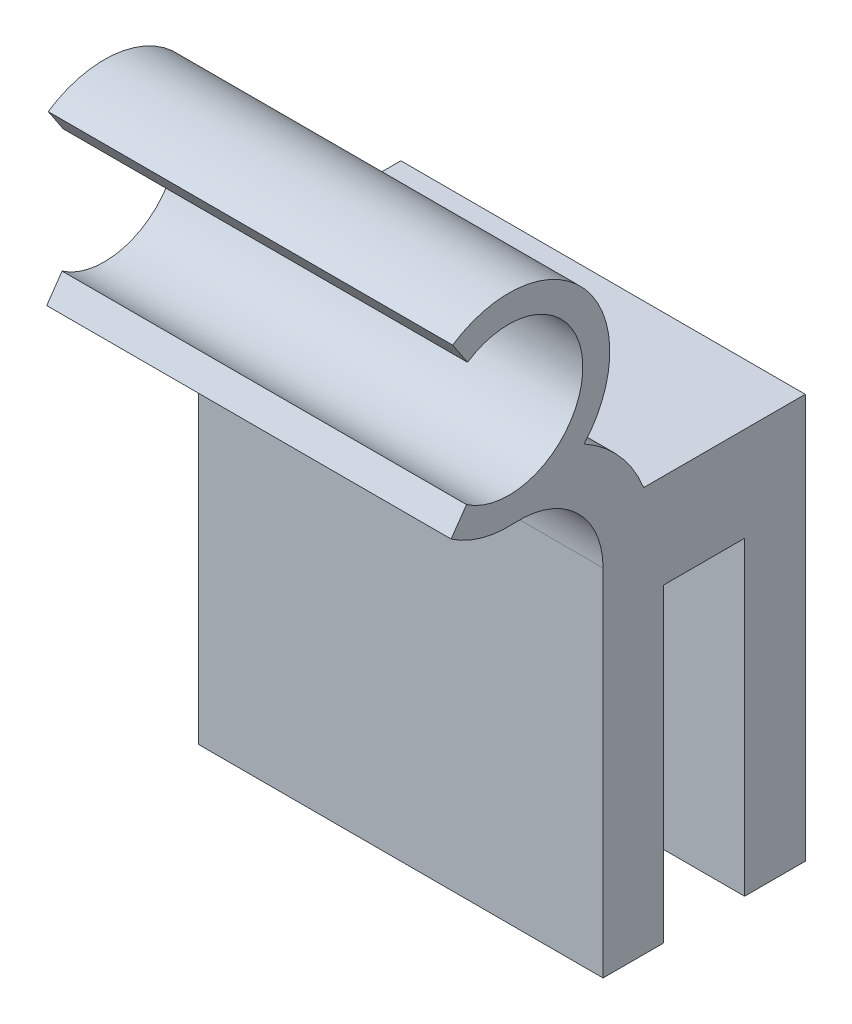
ISO-10303-21;
HEADER;
FILE_DESCRIPTION(('STEP AP214'),'2;1');
FILE_NAME('part.step','',(''),(''),'','','');
FILE_SCHEMA(('AUTOMOTIVE_DESIGN { 1 0 10303 214 1 1 1 1 }'));
ENDSEC;
DATA;
#1=APPLICATION_CONTEXT('core data for automotive mechanical design processes');
#2=APPLICATION_PROTOCOL_DEFINITION('international standard','automotive_design',2000,#1);
#3=PRODUCT_CONTEXT('',#1,'mechanical');
#4=PRODUCT('Part','Part','',(#3));
#5=PRODUCT_RELATED_PRODUCT_CATEGORY('part','',(#4));
#6=PRODUCT_DEFINITION_FORMATION('','',#4);
#7=PRODUCT_DEFINITION_CONTEXT('part definition',#1,'design');
#8=PRODUCT_DEFINITION('design','',#6,#7);
#9=PRODUCT_DEFINITION_SHAPE('','',#8);
#10=(LENGTH_UNIT() NAMED_UNIT(*) SI_UNIT(.MILLI.,.METRE.));
#11=(NAMED_UNIT(*) PLANE_ANGLE_UNIT() SI_UNIT($,.RADIAN.));
#12=(NAMED_UNIT(*) SI_UNIT($,.STERADIAN.) SOLID_ANGLE_UNIT());
#13=UNCERTAINTY_MEASURE_WITH_UNIT(LENGTH_MEASURE(1.E-05),#10,'distance_accuracy_value','');
#14=(GEOMETRIC_REPRESENTATION_CONTEXT(3) GLOBAL_UNCERTAINTY_ASSIGNED_CONTEXT((#13)) GLOBAL_UNIT_ASSIGNED_CONTEXT((#10,
#11,#12)) REPRESENTATION_CONTEXT('',''));
#15=CARTESIAN_POINT('',(0.,0.,0.));
#16=DIRECTION('',(0.,0.,1.));
#17=DIRECTION('',(1.,0.,0.));
#18=AXIS2_PLACEMENT_3D('',#15,#16,#17);
#19=CARTESIAN_POINT('',(15.,6.86224857327043,13.6819162353637));
#20=DIRECTION('',(-1.,0.,0.));
#21=DIRECTION('',(0.,0.,1.));
#22=AXIS2_PLACEMENT_3D('',#19,#20,#21);
#23=CYLINDRICAL_SURFACE('',#22,9.89666231497633);
#24=CARTESIAN_POINT('',(-15.,6.86224857327043,13.6819162353637));
#25=DIRECTION('',(1.,0.,0.));
#26=DIRECTION('',(0.,0.,-1.));
#27=AXIS2_PLACEMENT_3D('',#24,#25,#26);
#28=CIRCLE('',#27,9.89666231497633);
#29=CARTESIAN_POINT('',(-15.,10.5196850393701,4.48587994394355));
#30=VERTEX_POINT('',#29);
#31=CARTESIAN_POINT('',(-15.,15.5281910752581,8.90223365919645));
#32=VERTEX_POINT('',#31);
#33=EDGE_CURVE('E186',#30,#32,#28,.T.);
#34=ORIENTED_EDGE('',*,*,#33,.T.);
#35=DIRECTION('',(-1.,0.,0.));
#36=VECTOR('',#35,1.);
#37=CARTESIAN_POINT('',(15.,15.5281910752581,8.90223365919645));
#38=LINE('',#37,#36);
#39=CARTESIAN_POINT('',(15.,15.5281910752581,8.90223365919645));
#40=VERTEX_POINT('',#39);
#41=EDGE_CURVE('E11',#40,#32,#38,.T.);
#42=ORIENTED_EDGE('',*,*,#41,.F.);
#43=CARTESIAN_POINT('',(15.,6.86224857327043,13.6819162353637));
#44=DIRECTION('',(1.,0.,0.));
#45=DIRECTION('',(0.,0.,-1.));
#46=AXIS2_PLACEMENT_3D('',#43,#44,#45);
#47=CIRCLE('',#46,9.89666231497633);
#48=CARTESIAN_POINT('',(15.,10.5196850393701,4.48587994394355));
#49=VERTEX_POINT('',#48);
#50=EDGE_CURVE('E229',#49,#40,#47,.T.);
#51=ORIENTED_EDGE('',*,*,#50,.F.);
#52=DIRECTION('',(-1.,0.,0.));
#53=VECTOR('',#52,1.);
#54=CARTESIAN_POINT('',(15.,10.5196850393701,4.48587994394355));
#55=LINE('',#54,#53);
#56=EDGE_CURVE('E182',#49,#30,#55,.T.);
#57=ORIENTED_EDGE('',*,*,#56,.T.);
#58=EDGE_LOOP('',(#34,#42,#51,#57));
#59=FACE_BOUND('',#58,.T.);
#60=ADVANCED_FACE('F43',(#59),#23,.T.);
#61=CARTESIAN_POINT('',(15.,20.5196850393701,14.5));
#62=DIRECTION('',(-1.,0.,0.));
#63=DIRECTION('',(0.,0.,1.));
#64=AXIS2_PLACEMENT_3D('',#61,#62,#63);
#65=CYLINDRICAL_SURFACE('',#64,7.5);
#66=CARTESIAN_POINT('',(-15.,20.5196850393701,14.5));
#67=DIRECTION('',(1.,0.,0.));
#68=DIRECTION('',(0.,0.,-1.));
#69=AXIS2_PLACEMENT_3D('',#66,#67,#68);
#70=CIRCLE('',#69,7.5);
#71=CARTESIAN_POINT('',(-15.,26.7607964667778,18.6591499312577));
#72=VERTEX_POINT('',#71);
#73=EDGE_CURVE('E190',#32,#72,#70,.T.);
#74=ORIENTED_EDGE('',*,*,#73,.T.);
#75=DIRECTION('',(-1.,0.,0.));
#76=VECTOR('',#75,1.);
#77=CARTESIAN_POINT('',(15.,26.7607964667778,18.6591499312577));
#78=LINE('',#77,#76);
#79=CARTESIAN_POINT('',(15.,26.7607964667778,18.6591499312577));
#80=VERTEX_POINT('',#79);
#81=EDGE_CURVE('E52',#80,#72,#78,.T.);
#82=ORIENTED_EDGE('',*,*,#81,.F.);
#83=CARTESIAN_POINT('',(15.,20.5196850393701,14.5));
#84=DIRECTION('',(1.,0.,0.));
#85=DIRECTION('',(0.,0.,-1.));
#86=AXIS2_PLACEMENT_3D('',#83,#84,#85);
#87=CIRCLE('',#86,7.5);
#88=EDGE_CURVE('E124',#40,#80,#87,.T.);
#89=ORIENTED_EDGE('',*,*,#88,.F.);
#90=ORIENTED_EDGE('',*,*,#41,.T.);
#91=EDGE_LOOP('',(#74,#82,#89,#90));
#92=FACE_BOUND('',#91,.T.);
#93=ADVANCED_FACE('F344',(#92),#65,.T.);
#94=CARTESIAN_POINT('',(15.,26.7607964667778,18.6591499312577));
#95=DIRECTION('',(0.,0.554553324167686,-0.832148190321032));
#96=DIRECTION('',(0.,0.832148190321032,0.554553324167686));
#97=AXIS2_PLACEMENT_3D('',#94,#95,#96);
#98=PLANE('',#97);
#99=DIRECTION('',(0.,-0.832148190321032,-0.554553324167686));
#100=VECTOR('',#99,1.);
#101=CARTESIAN_POINT('',(-15.,26.7607964667778,18.6591499312577));
#102=LINE('',#101,#100);
#103=CARTESIAN_POINT('',(-15.,25.0965000861358,17.5500432829223));
#104=VERTEX_POINT('',#103);
#105=EDGE_CURVE('E193',#72,#104,#102,.T.);
#106=ORIENTED_EDGE('',*,*,#105,.T.);
#107=DIRECTION('',(-1.,0.,0.));
#108=VECTOR('',#107,1.);
#109=CARTESIAN_POINT('',(15.,25.0965000861358,17.5500432829223));
#110=LINE('',#109,#108);
#111=CARTESIAN_POINT('',(15.,25.0965000861358,17.5500432829223));
#112=VERTEX_POINT('',#111);
#113=EDGE_CURVE('E268',#112,#104,#110,.T.);
#114=ORIENTED_EDGE('',*,*,#113,.F.);
#115=DIRECTION('',(0.,-0.832148190321032,-0.554553324167686));
#116=VECTOR('',#115,1.);
#117=CARTESIAN_POINT('',(15.,26.7607964667778,18.6591499312577));
#118=LINE('',#117,#116);
#119=EDGE_CURVE('E278',#80,#112,#118,.T.);
#120=ORIENTED_EDGE('',*,*,#119,.F.);
#121=ORIENTED_EDGE('',*,*,#81,.T.);
#122=EDGE_LOOP('',(#106,#114,#120,#121));
#123=FACE_BOUND('',#122,.T.);
#124=ADVANCED_FACE('F276',(#123),#98,.F.);
#125=CARTESIAN_POINT('',(15.,20.5196850393701,14.5));
#126=DIRECTION('',(-1.,0.,0.));
#127=DIRECTION('',(0.,0.,1.));
#128=AXIS2_PLACEMENT_3D('',#125,#126,#127);
#129=CYLINDRICAL_SURFACE('',#128,5.5);
#130=CARTESIAN_POINT('',(-15.,20.5196850393701,14.5));
#131=DIRECTION('',(-1.,0.,0.));
#132=DIRECTION('',(0.,0.,-1.));
#133=AXIS2_PLACEMENT_3D('',#130,#131,#132);
#134=CIRCLE('',#133,5.5);
#135=CARTESIAN_POINT('',(-15.,15.9969098743688,17.6296173578966));
#136=VERTEX_POINT('',#135);
#137=EDGE_CURVE('E196',#104,#136,#134,.T.);
#138=ORIENTED_EDGE('',*,*,#137,.T.);
#139=DIRECTION('',(-1.,0.,0.));
#140=VECTOR('',#139,1.);
#141=CARTESIAN_POINT('',(15.,15.9969098743688,17.6296173578966));
#142=LINE('',#141,#140);
#143=CARTESIAN_POINT('',(15.,15.9969098743688,17.6296173578966));
#144=VERTEX_POINT('',#143);
#145=EDGE_CURVE('E264',#144,#136,#142,.T.);
#146=ORIENTED_EDGE('',*,*,#145,.F.);
#147=CARTESIAN_POINT('',(15.,20.5196850393701,14.5));
#148=DIRECTION('',(-1.,0.,0.));
#149=DIRECTION('',(0.,0.,-1.));
#150=AXIS2_PLACEMENT_3D('',#147,#148,#149);
#151=CIRCLE('',#150,5.5);
#152=EDGE_CURVE('E297',#112,#144,#151,.T.);
#153=ORIENTED_EDGE('',*,*,#152,.F.);
#154=ORIENTED_EDGE('',*,*,#113,.T.);
#155=EDGE_LOOP('',(#138,#146,#153,#154));
#156=FACE_BOUND('',#155,.T.);
#157=ADVANCED_FACE('F287',(#156),#129,.F.);
#158=CARTESIAN_POINT('',(15.,14.3522643598228,18.7676600334953));
#159=DIRECTION('',(0.,-0.569021337799368,-0.822322757272968));
#160=DIRECTION('',(0.,0.822322757272968,-0.569021337799369));
#161=AXIS2_PLACEMENT_3D('',#158,#159,#160);
#162=PLANE('',#161);
#163=DIRECTION('',(0.,-0.822322757272968,0.569021337799368));
#164=VECTOR('',#163,1.);
#165=CARTESIAN_POINT('',(-15.,14.3522643598228,18.7676600334953));
#166=LINE('',#165,#164);
#167=CARTESIAN_POINT('',(-15.,14.3522643598228,18.7676600334953));
#168=VERTEX_POINT('',#167);
#169=EDGE_CURVE('E199',#136,#168,#166,.T.);
#170=ORIENTED_EDGE('',*,*,#169,.T.);
#171=DIRECTION('',(-1.,0.,0.));
#172=VECTOR('',#171,1.);
#173=CARTESIAN_POINT('',(15.,14.3522643598228,18.7676600334953));
#174=LINE('',#173,#172);
#175=CARTESIAN_POINT('',(15.,14.3522643598228,18.7676600334953));
#176=VERTEX_POINT('',#175);
#177=EDGE_CURVE('E260',#176,#168,#174,.T.);
#178=ORIENTED_EDGE('',*,*,#177,.F.);
#179=DIRECTION('',(0.,-0.822322757272968,0.569021337799368));
#180=VECTOR('',#179,1.);
#181=CARTESIAN_POINT('',(15.,14.3522643598228,18.7676600334953));
#182=LINE('',#181,#180);
#183=EDGE_CURVE('E293',#144,#176,#182,.T.);
#184=ORIENTED_EDGE('',*,*,#183,.F.);
#185=ORIENTED_EDGE('',*,*,#145,.T.);
#186=EDGE_LOOP('',(#170,#178,#184,#185));
#187=FACE_BOUND('',#186,.T.);
#188=ADVANCED_FACE('F291',(#187),#162,.F.);
#189=CARTESIAN_POINT('',(15.,20.5196850393701,14.5));
#190=DIRECTION('',(-1.,0.,0.));
#191=DIRECTION('',(0.,0.,1.));
#192=AXIS2_PLACEMENT_3D('',#189,#190,#191);
#193=CYLINDRICAL_SURFACE('',#192,7.5);
#194=CARTESIAN_POINT('',(-15.,20.5196850393701,14.5));
#195=DIRECTION('',(1.,0.,0.));
#196=DIRECTION('',(0.,0.,-1.));
#197=AXIS2_PLACEMENT_3D('',#194,#195,#196);
#198=CIRCLE('',#197,7.5);
#199=CARTESIAN_POINT('',(-15.,13.0331040858196,14.0515519807881));
#200=VERTEX_POINT('',#199);
#201=EDGE_CURVE('E202',#168,#200,#198,.T.);
#202=ORIENTED_EDGE('',*,*,#201,.T.);
#203=DIRECTION('',(-1.,0.,0.));
#204=VECTOR('',#203,1.);
#205=CARTESIAN_POINT('',(15.,13.0331040858196,14.0515519807881));
#206=LINE('',#205,#204);
#207=CARTESIAN_POINT('',(15.,13.0331040858196,14.0515519807881));
#208=VERTEX_POINT('',#207);
#209=EDGE_CURVE('E256',#208,#200,#206,.T.);
#210=ORIENTED_EDGE('',*,*,#209,.F.);
#211=CARTESIAN_POINT('',(15.,20.5196850393701,14.5));
#212=DIRECTION('',(1.,0.,0.));
#213=DIRECTION('',(0.,0.,-1.));
#214=AXIS2_PLACEMENT_3D('',#211,#212,#213);
#215=CIRCLE('',#214,7.5);
#216=EDGE_CURVE('E296',#176,#208,#215,.T.);
#217=ORIENTED_EDGE('',*,*,#216,.F.);
#218=ORIENTED_EDGE('',*,*,#177,.T.);
#219=EDGE_LOOP('',(#202,#210,#217,#218));
#220=FACE_BOUND('',#219,.T.);
#221=ADVANCED_FACE('F357',(#220),#193,.T.);
#222=CARTESIAN_POINT('',(15.,6.86224857327043,13.6819162353637));
#223=DIRECTION('',(-1.,0.,0.));
#224=DIRECTION('',(0.,0.,1.));
#225=AXIS2_PLACEMENT_3D('',#222,#223,#224);
#226=CYLINDRICAL_SURFACE('',#225,6.18191623536374);
#227=CARTESIAN_POINT('',(-15.,6.86224857327043,13.6819162353637));
#228=DIRECTION('',(-1.,0.,0.));
#229=DIRECTION('',(0.,0.,-1.));
#230=AXIS2_PLACEMENT_3D('',#227,#228,#229);
#231=CIRCLE('',#230,6.18191623536374);
#232=CARTESIAN_POINT('',(-15.,6.86224857327043,7.5));
#233=VERTEX_POINT('',#232);
#234=EDGE_CURVE('E205',#200,#233,#231,.T.);
#235=ORIENTED_EDGE('',*,*,#234,.T.);
#236=DIRECTION('',(-1.,0.,0.));
#237=VECTOR('',#236,1.);
#238=CARTESIAN_POINT('',(15.,6.86224857327043,7.5));
#239=LINE('',#238,#237);
#240=CARTESIAN_POINT('',(15.,6.86224857327043,7.5));
#241=VERTEX_POINT('',#240);
#242=EDGE_CURVE('E252',#241,#233,#239,.T.);
#243=ORIENTED_EDGE('',*,*,#242,.F.);
#244=CARTESIAN_POINT('',(15.,6.86224857327043,13.6819162353637));
#245=DIRECTION('',(-1.,0.,0.));
#246=DIRECTION('',(0.,0.,-1.));
#247=AXIS2_PLACEMENT_3D('',#244,#245,#246);
#248=CIRCLE('',#247,6.18191623536374);
#249=EDGE_CURVE('E301',#208,#241,#248,.T.);
#250=ORIENTED_EDGE('',*,*,#249,.F.);
#251=ORIENTED_EDGE('',*,*,#209,.T.);
#252=EDGE_LOOP('',(#235,#243,#250,#251));
#253=FACE_BOUND('',#252,.T.);
#254=ADVANCED_FACE('F360',(#253),#226,.F.);
#255=CARTESIAN_POINT('',(15.,6.86224857327043,7.5));
#256=DIRECTION('',(0.,0.,-1.));
#257=DIRECTION('',(0.,1.,0.));
#258=AXIS2_PLACEMENT_3D('',#255,#256,#257);
#259=PLANE('',#258);
#260=DIRECTION('',(0.,-1.,0.));
#261=VECTOR('',#260,1.);
#262=CARTESIAN_POINT('',(-15.,6.86224857327043,7.5));
#263=LINE('',#262,#261);
#264=CARTESIAN_POINT('',(-15.,-19.4803149606299,7.5));
#265=VERTEX_POINT('',#264);
#266=EDGE_CURVE('E208',#233,#265,#263,.T.);
#267=ORIENTED_EDGE('',*,*,#266,.T.);
#268=DIRECTION('',(-1.,0.,0.));
#269=VECTOR('',#268,1.);
#270=CARTESIAN_POINT('',(15.,-19.4803149606299,7.5));
#271=LINE('',#270,#269);
#272=CARTESIAN_POINT('',(15.,-19.4803149606299,7.5));
#273=VERTEX_POINT('',#272);
#274=EDGE_CURVE('E248',#273,#265,#271,.T.);
#275=ORIENTED_EDGE('',*,*,#274,.F.);
#276=DIRECTION('',(0.,-1.,0.));
#277=VECTOR('',#276,1.);
#278=CARTESIAN_POINT('',(15.,6.86224857327043,7.5));
#279=LINE('',#278,#277);
#280=EDGE_CURVE('E308',#241,#273,#279,.T.);
#281=ORIENTED_EDGE('',*,*,#280,.F.);
#282=ORIENTED_EDGE('',*,*,#242,.T.);
#283=EDGE_LOOP('',(#267,#275,#281,#282));
#284=FACE_BOUND('',#283,.T.);
#285=ADVANCED_FACE('F364',(#284),#259,.F.);
#286=CARTESIAN_POINT('',(15.,-19.4803149606299,7.5));
#287=DIRECTION('',(0.,1.,0.));
#288=DIRECTION('',(0.,0.,1.));
#289=AXIS2_PLACEMENT_3D('',#286,#287,#288);
#290=PLANE('',#289);
#291=DIRECTION('',(0.,0.,-1.));
#292=VECTOR('',#291,1.);
#293=CARTESIAN_POINT('',(-15.,-19.4803149606299,7.5));
#294=LINE('',#293,#292);
#295=CARTESIAN_POINT('',(-15.,-19.4803149606299,3.));
#296=VERTEX_POINT('',#295);
#297=EDGE_CURVE('E211',#265,#296,#294,.T.);
#298=ORIENTED_EDGE('',*,*,#297,.T.);
#299=DIRECTION('',(-1.,0.,0.));
#300=VECTOR('',#299,1.);
#301=CARTESIAN_POINT('',(15.,-19.4803149606299,3.));
#302=LINE('',#301,#300);
#303=CARTESIAN_POINT('',(15.,-19.4803149606299,3.));
#304=VERTEX_POINT('',#303);
#305=EDGE_CURVE('E244',#304,#296,#302,.T.);
#306=ORIENTED_EDGE('',*,*,#305,.F.);
#307=DIRECTION('',(0.,0.,-1.));
#308=VECTOR('',#307,1.);
#309=CARTESIAN_POINT('',(15.,-19.4803149606299,7.5));
#310=LINE('',#309,#308);
#311=EDGE_CURVE('E311',#273,#304,#310,.T.);
#312=ORIENTED_EDGE('',*,*,#311,.F.);
#313=ORIENTED_EDGE('',*,*,#274,.T.);
#314=EDGE_LOOP('',(#298,#306,#312,#313));
#315=FACE_BOUND('',#314,.T.);
#316=ADVANCED_FACE('F368',(#315),#290,.F.);
#317=CARTESIAN_POINT('',(15.,-19.4803149606299,3.));
#318=DIRECTION('',(0.,0.,1.));
#319=DIRECTION('',(1.,0.,0.));
#320=AXIS2_PLACEMENT_3D('',#317,#318,#319);
#321=PLANE('',#320);
#322=DIRECTION('',(0.,1.,0.));
#323=VECTOR('',#322,1.);
#324=CARTESIAN_POINT('',(-15.,-19.4803149606299,3.));
#325=LINE('',#324,#323);
#326=CARTESIAN_POINT('',(-15.,3.51968503937008,3.));
#327=VERTEX_POINT('',#326);
#328=EDGE_CURVE('E214',#296,#327,#325,.T.);
#329=ORIENTED_EDGE('',*,*,#328,.T.);
#330=DIRECTION('',(-1.,0.,0.));
#331=VECTOR('',#330,1.);
#332=CARTESIAN_POINT('',(15.,3.51968503937008,3.));
#333=LINE('',#332,#331);
#334=CARTESIAN_POINT('',(15.,3.51968503937008,3.));
#335=VERTEX_POINT('',#334);
#336=EDGE_CURVE('E240',#335,#327,#333,.T.);
#337=ORIENTED_EDGE('',*,*,#336,.F.);
#338=DIRECTION('',(0.,1.,0.));
#339=VECTOR('',#338,1.);
#340=CARTESIAN_POINT('',(15.,-19.4803149606299,3.));
#341=LINE('',#340,#339);
#342=EDGE_CURVE('E314',#304,#335,#341,.T.);
#343=ORIENTED_EDGE('',*,*,#342,.F.);
#344=ORIENTED_EDGE('',*,*,#305,.T.);
#345=EDGE_LOOP('',(#329,#337,#343,#344));
#346=FACE_BOUND('',#345,.T.);
#347=ADVANCED_FACE('F372',(#346),#321,.F.);
#348=CARTESIAN_POINT('',(15.,3.51968503937008,3.));
#349=DIRECTION('',(0.,1.,0.));
#350=DIRECTION('',(0.,0.,1.));
#351=AXIS2_PLACEMENT_3D('',#348,#349,#350);
#352=PLANE('',#351);
#353=DIRECTION('',(0.,0.,-1.));
#354=VECTOR('',#353,1.);
#355=CARTESIAN_POINT('',(-15.,3.51968503937008,3.));
#356=LINE('',#355,#354);
#357=CARTESIAN_POINT('',(-15.,3.51968503937008,-3.));
#358=VERTEX_POINT('',#357);
#359=EDGE_CURVE('E217',#327,#358,#356,.T.);
#360=ORIENTED_EDGE('',*,*,#359,.T.);
#361=DIRECTION('',(-1.,0.,0.));
#362=VECTOR('',#361,1.);
#363=CARTESIAN_POINT('',(15.,3.51968503937008,-3.));
#364=LINE('',#363,#362);
#365=CARTESIAN_POINT('',(15.,3.51968503937008,-3.));
#366=VERTEX_POINT('',#365);
#367=EDGE_CURVE('E236',#366,#358,#364,.T.);
#368=ORIENTED_EDGE('',*,*,#367,.F.);
#369=DIRECTION('',(0.,0.,-1.));
#370=VECTOR('',#369,1.);
#371=CARTESIAN_POINT('',(15.,3.51968503937008,3.));
#372=LINE('',#371,#370);
#373=EDGE_CURVE('E317',#335,#366,#372,.T.);
#374=ORIENTED_EDGE('',*,*,#373,.F.);
#375=ORIENTED_EDGE('',*,*,#336,.T.);
#376=EDGE_LOOP('',(#360,#368,#374,#375));
#377=FACE_BOUND('',#376,.T.);
#378=ADVANCED_FACE('F325',(#377),#352,.F.);
#379=CARTESIAN_POINT('',(15.,-19.4803149606299,-3.));
#380=DIRECTION('',(0.,0.,-1.));
#381=DIRECTION('',(-1.,0.,0.));
#382=AXIS2_PLACEMENT_3D('',#379,#380,#381);
#383=PLANE('',#382);
#384=DIRECTION('',(0.,-1.,0.));
#385=VECTOR('',#384,1.);
#386=CARTESIAN_POINT('',(-15.,-19.4803149606299,-3.));
#387=LINE('',#386,#385);
#388=CARTESIAN_POINT('',(-15.,-19.4803149606299,-3.));
#389=VERTEX_POINT('',#388);
#390=EDGE_CURVE('E220',#358,#389,#387,.T.);
#391=ORIENTED_EDGE('',*,*,#390,.T.);
#392=DIRECTION('',(-1.,0.,0.));
#393=VECTOR('',#392,1.);
#394=CARTESIAN_POINT('',(15.,-19.4803149606299,-3.));
#395=LINE('',#394,#393);
#396=CARTESIAN_POINT('',(15.,-19.4803149606299,-3.));
#397=VERTEX_POINT('',#396);
#398=EDGE_CURVE('E175',#397,#389,#395,.T.);
#399=ORIENTED_EDGE('',*,*,#398,.F.);
#400=DIRECTION('',(0.,-1.,0.));
#401=VECTOR('',#400,1.);
#402=CARTESIAN_POINT('',(15.,-19.4803149606299,-3.));
#403=LINE('',#402,#401);
#404=EDGE_CURVE('E164',#366,#397,#403,.T.);
#405=ORIENTED_EDGE('',*,*,#404,.F.);
#406=ORIENTED_EDGE('',*,*,#367,.T.);
#407=EDGE_LOOP('',(#391,#399,#405,#406));
#408=FACE_BOUND('',#407,.T.);
#409=ADVANCED_FACE('F329',(#408),#383,.F.);
#410=CARTESIAN_POINT('',(15.,-19.4803149606299,-3.));
#411=DIRECTION('',(0.,1.,0.));
#412=DIRECTION('',(0.,0.,1.));
#413=AXIS2_PLACEMENT_3D('',#410,#411,#412);
#414=PLANE('',#413);
#415=DIRECTION('',(0.,0.,-1.));
#416=VECTOR('',#415,1.);
#417=CARTESIAN_POINT('',(-15.,-19.4803149606299,-3.));
#418=LINE('',#417,#416);
#419=CARTESIAN_POINT('',(-15.,-19.4803149606299,-7.5));
#420=VERTEX_POINT('',#419);
#421=EDGE_CURVE('E173',#389,#420,#418,.T.);
#422=ORIENTED_EDGE('',*,*,#421,.T.);
#423=DIRECTION('',(-1.,0.,0.));
#424=VECTOR('',#423,1.);
#425=CARTESIAN_POINT('',(15.,-19.4803149606299,-7.5));
#426=LINE('',#425,#424);
#427=CARTESIAN_POINT('',(15.,-19.4803149606299,-7.5));
#428=VERTEX_POINT('',#427);
#429=EDGE_CURVE('E170',#428,#420,#426,.T.);
#430=ORIENTED_EDGE('',*,*,#429,.F.);
#431=DIRECTION('',(0.,0.,-1.));
#432=VECTOR('',#431,1.);
#433=CARTESIAN_POINT('',(15.,-19.4803149606299,-3.));
#434=LINE('',#433,#432);
#435=EDGE_CURVE('E158',#397,#428,#434,.T.);
#436=ORIENTED_EDGE('',*,*,#435,.F.);
#437=ORIENTED_EDGE('',*,*,#398,.T.);
#438=EDGE_LOOP('',(#422,#430,#436,#437));
#439=FACE_BOUND('',#438,.T.);
#440=ADVANCED_FACE('F171',(#439),#414,.F.);
#441=CARTESIAN_POINT('',(15.,10.5196850393701,-7.5));
#442=DIRECTION('',(0.,0.,1.));
#443=DIRECTION('',(0.,-1.,0.));
#444=AXIS2_PLACEMENT_3D('',#441,#442,#443);
#445=PLANE('',#444);
#446=DIRECTION('',(0.,1.,0.));
#447=VECTOR('',#446,1.);
#448=CARTESIAN_POINT('',(-15.,10.5196850393701,-7.5));
#449=LINE('',#448,#447);
#450=CARTESIAN_POINT('',(-15.,10.5196850393701,-7.5));
#451=VERTEX_POINT('',#450);
#452=EDGE_CURVE('E110',#420,#451,#449,.T.);
#453=ORIENTED_EDGE('',*,*,#452,.T.);
#454=DIRECTION('',(-1.,0.,0.));
#455=VECTOR('',#454,1.);
#456=CARTESIAN_POINT('',(15.,10.5196850393701,-7.5));
#457=LINE('',#456,#455);
#458=CARTESIAN_POINT('',(15.,10.5196850393701,-7.5));
#459=VERTEX_POINT('',#458);
#460=EDGE_CURVE('E176',#459,#451,#457,.T.);
#461=ORIENTED_EDGE('',*,*,#460,.F.);
#462=DIRECTION('',(0.,1.,0.));
#463=VECTOR('',#462,1.);
#464=CARTESIAN_POINT('',(15.,10.5196850393701,-7.5));
#465=LINE('',#464,#463);
#466=EDGE_CURVE('E162',#428,#459,#465,.T.);
#467=ORIENTED_EDGE('',*,*,#466,.F.);
#468=ORIENTED_EDGE('',*,*,#429,.T.);
#469=EDGE_LOOP('',(#453,#461,#467,#468));
#470=FACE_BOUND('',#469,.T.);
#471=ADVANCED_FACE('F178',(#470),#445,.F.);
#472=CARTESIAN_POINT('',(15.,10.5196850393701,4.48587994394355));
#473=DIRECTION('',(0.,-1.,0.));
#474=DIRECTION('',(0.,0.,-1.));
#475=AXIS2_PLACEMENT_3D('',#472,#473,#474);
#476=PLANE('',#475);
#477=DIRECTION('',(0.,0.,1.));
#478=VECTOR('',#477,1.);
#479=CARTESIAN_POINT('',(-15.,10.5196850393701,4.48587994394355));
#480=LINE('',#479,#478);
#481=EDGE_CURVE('E116',#451,#30,#480,.T.);
#482=ORIENTED_EDGE('',*,*,#481,.T.);
#483=ORIENTED_EDGE('',*,*,#56,.F.);
#484=DIRECTION('',(0.,0.,1.));
#485=VECTOR('',#484,1.);
#486=CARTESIAN_POINT('',(15.,10.5196850393701,4.48587994394355));
#487=LINE('',#486,#485);
#488=EDGE_CURVE('E60',#459,#49,#487,.T.);
#489=ORIENTED_EDGE('',*,*,#488,.F.);
#490=ORIENTED_EDGE('',*,*,#460,.T.);
#491=EDGE_LOOP('',(#482,#483,#489,#490));
#492=FACE_BOUND('',#491,.T.);
#493=ADVANCED_FACE('F333',(#492),#476,.F.);
#494=CARTESIAN_POINT('',(15.,6.86224857327043,13.6819162353637));
#495=DIRECTION('',(1.,0.,0.));
#496=DIRECTION('',(0.,0.,-1.));
#497=AXIS2_PLACEMENT_3D('',#494,#495,#496);
#498=PLANE('',#497);
#499=ORIENTED_EDGE('',*,*,#50,.T.);
#500=ORIENTED_EDGE('',*,*,#88,.T.);
#501=ORIENTED_EDGE('',*,*,#119,.T.);
#502=ORIENTED_EDGE('',*,*,#152,.T.);
#503=ORIENTED_EDGE('',*,*,#183,.T.);
#504=ORIENTED_EDGE('',*,*,#216,.T.);
#505=ORIENTED_EDGE('',*,*,#249,.T.);
#506=ORIENTED_EDGE('',*,*,#280,.T.);
#507=ORIENTED_EDGE('',*,*,#311,.T.);
#508=ORIENTED_EDGE('',*,*,#342,.T.);
#509=ORIENTED_EDGE('',*,*,#373,.T.);
#510=ORIENTED_EDGE('',*,*,#404,.T.);
#511=ORIENTED_EDGE('',*,*,#435,.T.);
#512=ORIENTED_EDGE('',*,*,#466,.T.);
#513=ORIENTED_EDGE('',*,*,#488,.T.);
#514=EDGE_LOOP('',(#499,#500,#501,#502,#503,#504,#505,#506,#507,#508,#509,#510,#511,#512,#513));
#515=FACE_BOUND('',#514,.T.);
#516=ADVANCED_FACE('F160',(#515),#498,.T.);
#517=CARTESIAN_POINT('',(-15.,6.86224857327043,13.6819162353637));
#518=DIRECTION('',(1.,0.,0.));
#519=DIRECTION('',(0.,0.,-1.));
#520=AXIS2_PLACEMENT_3D('',#517,#518,#519);
#521=PLANE('',#520);
#522=ORIENTED_EDGE('',*,*,#33,.F.);
#523=ORIENTED_EDGE('',*,*,#481,.F.);
#524=ORIENTED_EDGE('',*,*,#452,.F.);
#525=ORIENTED_EDGE('',*,*,#421,.F.);
#526=ORIENTED_EDGE('',*,*,#390,.F.);
#527=ORIENTED_EDGE('',*,*,#359,.F.);
#528=ORIENTED_EDGE('',*,*,#328,.F.);
#529=ORIENTED_EDGE('',*,*,#297,.F.);
#530=ORIENTED_EDGE('',*,*,#266,.F.);
#531=ORIENTED_EDGE('',*,*,#234,.F.);
#532=ORIENTED_EDGE('',*,*,#201,.F.);
#533=ORIENTED_EDGE('',*,*,#169,.F.);
#534=ORIENTED_EDGE('',*,*,#137,.F.);
#535=ORIENTED_EDGE('',*,*,#105,.F.);
#536=ORIENTED_EDGE('',*,*,#73,.F.);
#537=EDGE_LOOP('',(#522,#523,#524,#525,#526,#527,#528,#529,#530,#531,#532,#533,#534,#535,#536));
#538=FACE_BOUND('',#537,.T.);
#539=ADVANCED_FACE('F282',(#538),#521,.F.);
#540=CLOSED_SHELL('',(#60,#93,#124,#157,#188,#221,#254,#285,#316,#347,#378,#409,#440,#471,#493,
#516,#539));
#541=MANIFOLD_SOLID_BREP('B2',#540);
#542=ADVANCED_BREP_SHAPE_REPRESENTATION('',(#18,#541),#14);
#543=SHAPE_DEFINITION_REPRESENTATION(#9,#542);
ENDSEC;
END-ISO-10303-21;
